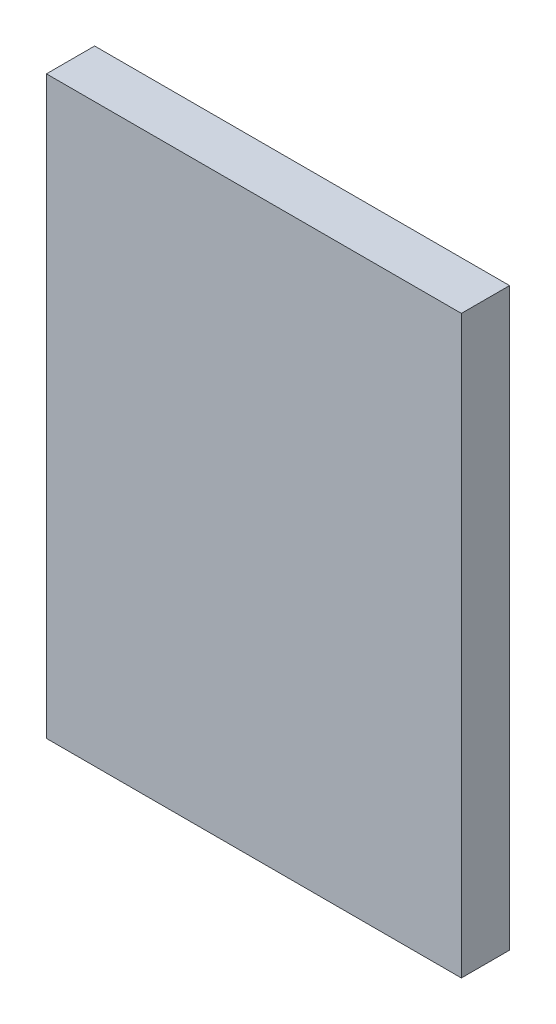
ISO-10303-21;
HEADER;
FILE_DESCRIPTION(('STEP AP214'),'2;1');
FILE_NAME('part.step','',(''),(''),'','','');
FILE_SCHEMA(('AUTOMOTIVE_DESIGN { 1 0 10303 214 1 1 1 1 }'));
ENDSEC;
DATA;
#1=APPLICATION_CONTEXT('core data for automotive mechanical design processes');
#2=APPLICATION_PROTOCOL_DEFINITION('international standard','automotive_design',2000,#1);
#3=PRODUCT_CONTEXT('',#1,'mechanical');
#4=PRODUCT('Part','Part','',(#3));
#5=PRODUCT_RELATED_PRODUCT_CATEGORY('part','',(#4));
#6=PRODUCT_DEFINITION_FORMATION('','',#4);
#7=PRODUCT_DEFINITION_CONTEXT('part definition',#1,'design');
#8=PRODUCT_DEFINITION('design','',#6,#7);
#9=PRODUCT_DEFINITION_SHAPE('','',#8);
#10=(LENGTH_UNIT() NAMED_UNIT(*) SI_UNIT(.MILLI.,.METRE.));
#11=(NAMED_UNIT(*) PLANE_ANGLE_UNIT() SI_UNIT($,.RADIAN.));
#12=(NAMED_UNIT(*) SI_UNIT($,.STERADIAN.) SOLID_ANGLE_UNIT());
#13=UNCERTAINTY_MEASURE_WITH_UNIT(LENGTH_MEASURE(1.E-05),#10,'distance_accuracy_value','');
#14=(GEOMETRIC_REPRESENTATION_CONTEXT(3) GLOBAL_UNCERTAINTY_ASSIGNED_CONTEXT((#13)) GLOBAL_UNIT_ASSIGNED_CONTEXT((#10,
#11,#12)) REPRESENTATION_CONTEXT('',''));
#15=CARTESIAN_POINT('',(0.,0.,0.));
#16=DIRECTION('',(0.,0.,1.));
#17=DIRECTION('',(1.,0.,0.));
#18=AXIS2_PLACEMENT_3D('',#15,#16,#17);
#19=CARTESIAN_POINT('',(0.,0.,0.018));
#20=DIRECTION('',(0.,0.,1.));
#21=DIRECTION('',(1.,0.,0.));
#22=AXIS2_PLACEMENT_3D('',#19,#20,#21);
#23=PLANE('',#22);
#24=DIRECTION('',(-1.,0.,0.));
#25=VECTOR('',#24,1.);
#26=CARTESIAN_POINT('',(-0.1243863753,0.1075,0.018));
#27=LINE('',#26,#25);
#28=CARTESIAN_POINT('',(0.2575,0.1075,0.0179999999999999));
#29=VERTEX_POINT('',#28);
#30=CARTESIAN_POINT('',(0.1025,0.1075,0.018));
#31=VERTEX_POINT('',#30);
#32=EDGE_CURVE('E11',#29,#31,#27,.T.);
#33=ORIENTED_EDGE('',*,*,#32,.T.);
#34=DIRECTION('',(0.,-1.,0.));
#35=VECTOR('',#34,1.);
#36=CARTESIAN_POINT('',(0.1025,0.02125,0.018));
#37=LINE('',#36,#35);
#38=CARTESIAN_POINT('',(0.1025,-0.1075,0.018));
#39=VERTEX_POINT('',#38);
#40=EDGE_CURVE('E24',#31,#39,#37,.T.);
#41=ORIENTED_EDGE('',*,*,#40,.T.);
#42=DIRECTION('',(1.,0.,0.));
#43=VECTOR('',#42,1.);
#44=CARTESIAN_POINT('',(-0.0468863753000002,-0.1075,0.018));
#45=LINE('',#44,#43);
#46=CARTESIAN_POINT('',(0.2575,-0.1075,0.0179999999999999));
#47=VERTEX_POINT('',#46);
#48=EDGE_CURVE('E88',#39,#47,#45,.T.);
#49=ORIENTED_EDGE('',*,*,#48,.T.);
#50=DIRECTION('',(0.,1.,0.));
#51=VECTOR('',#50,1.);
#52=CARTESIAN_POINT('',(0.2575,0.12875,0.0179999999999999));
#53=LINE('',#52,#51);
#54=EDGE_CURVE('E72',#47,#29,#53,.T.);
#55=ORIENTED_EDGE('',*,*,#54,.T.);
#56=EDGE_LOOP('',(#33,#41,#49,#55));
#57=FACE_BOUND('',#56,.T.);
#58=ADVANCED_FACE('F17',(#57),#23,.T.);
#59=CARTESIAN_POINT('',(0.1025,0.1075,0.018));
#60=DIRECTION('',(0.,1.,0.));
#61=DIRECTION('',(1.,0.,0.));
#62=AXIS2_PLACEMENT_3D('',#59,#60,#61);
#63=PLANE('',#62);
#64=DIRECTION('',(1.,0.,0.));
#65=VECTOR('',#64,1.);
#66=CARTESIAN_POINT('',(0.14125,0.1075,0.));
#67=LINE('',#66,#65);
#68=CARTESIAN_POINT('',(0.1025,0.1075,0.));
#69=VERTEX_POINT('',#68);
#70=CARTESIAN_POINT('',(0.2575,0.1075,0.));
#71=VERTEX_POINT('',#70);
#72=EDGE_CURVE('E75',#69,#71,#67,.T.);
#73=ORIENTED_EDGE('',*,*,#72,.F.);
#74=DIRECTION('',(0.,0.,-1.));
#75=VECTOR('',#74,1.);
#76=CARTESIAN_POINT('',(0.1025,0.1075,0.018));
#77=LINE('',#76,#75);
#78=EDGE_CURVE('E83',#31,#69,#77,.T.);
#79=ORIENTED_EDGE('',*,*,#78,.F.);
#80=ORIENTED_EDGE('',*,*,#32,.F.);
#81=DIRECTION('',(0.,0.,-1.));
#82=VECTOR('',#81,1.);
#83=CARTESIAN_POINT('',(0.2575,0.1075,0.0179999999999999));
#84=LINE('',#83,#82);
#85=EDGE_CURVE('E81',#29,#71,#84,.T.);
#86=ORIENTED_EDGE('',*,*,#85,.T.);
#87=EDGE_LOOP('',(#73,#79,#80,#86));
#88=FACE_BOUND('',#87,.T.);
#89=ADVANCED_FACE('F91',(#88),#63,.T.);
#90=CARTESIAN_POINT('',(0.1025,-0.1075,0.018));
#91=DIRECTION('',(-1.,0.,0.));
#92=DIRECTION('',(0.,1.,0.));
#93=AXIS2_PLACEMENT_3D('',#90,#91,#92);
#94=PLANE('',#93);
#95=DIRECTION('',(0.,1.,0.));
#96=VECTOR('',#95,1.);
#97=CARTESIAN_POINT('',(0.1025,-0.05375,0.));
#98=LINE('',#97,#96);
#99=CARTESIAN_POINT('',(0.1025,-0.1075,0.));
#100=VERTEX_POINT('',#99);
#101=EDGE_CURVE('E79',#100,#69,#98,.T.);
#102=ORIENTED_EDGE('',*,*,#101,.F.);
#103=DIRECTION('',(0.,0.,-1.));
#104=VECTOR('',#103,1.);
#105=CARTESIAN_POINT('',(0.1025,-0.1075,0.018));
#106=LINE('',#105,#104);
#107=EDGE_CURVE('E61',#39,#100,#106,.T.);
#108=ORIENTED_EDGE('',*,*,#107,.F.);
#109=ORIENTED_EDGE('',*,*,#40,.F.);
#110=ORIENTED_EDGE('',*,*,#78,.T.);
#111=EDGE_LOOP('',(#102,#108,#109,#110));
#112=FACE_BOUND('',#111,.T.);
#113=ADVANCED_FACE('F90',(#112),#94,.T.);
#114=CARTESIAN_POINT('',(0.2575,-0.1075,0.0179999999999999));
#115=DIRECTION('',(0.,-1.,0.));
#116=DIRECTION('',(-1.,0.,0.));
#117=AXIS2_PLACEMENT_3D('',#114,#115,#116);
#118=PLANE('',#117);
#119=DIRECTION('',(-1.,0.,0.));
#120=VECTOR('',#119,1.);
#121=CARTESIAN_POINT('',(0.21875,-0.1075,0.));
#122=LINE('',#121,#120);
#123=CARTESIAN_POINT('',(0.2575,-0.1075,0.));
#124=VERTEX_POINT('',#123);
#125=EDGE_CURVE('E55',#124,#100,#122,.T.);
#126=ORIENTED_EDGE('',*,*,#125,.F.);
#127=DIRECTION('',(0.,0.,-1.));
#128=VECTOR('',#127,1.);
#129=CARTESIAN_POINT('',(0.2575,-0.1075,0.0179999999999999));
#130=LINE('',#129,#128);
#131=EDGE_CURVE('E59',#47,#124,#130,.T.);
#132=ORIENTED_EDGE('',*,*,#131,.F.);
#133=ORIENTED_EDGE('',*,*,#48,.F.);
#134=ORIENTED_EDGE('',*,*,#107,.T.);
#135=EDGE_LOOP('',(#126,#132,#133,#134));
#136=FACE_BOUND('',#135,.T.);
#137=ADVANCED_FACE('F57',(#136),#118,.T.);
#138=CARTESIAN_POINT('',(0.2575,0.1075,0.0179999999999999));
#139=DIRECTION('',(1.,0.,0.));
#140=DIRECTION('',(0.,-1.,0.));
#141=AXIS2_PLACEMENT_3D('',#138,#139,#140);
#142=PLANE('',#141);
#143=DIRECTION('',(0.,-1.,0.));
#144=VECTOR('',#143,1.);
#145=CARTESIAN_POINT('',(0.2575,0.0537500000000001,0.));
#146=LINE('',#145,#144);
#147=EDGE_CURVE('E71',#71,#124,#146,.T.);
#148=ORIENTED_EDGE('',*,*,#147,.F.);
#149=ORIENTED_EDGE('',*,*,#85,.F.);
#150=ORIENTED_EDGE('',*,*,#54,.F.);
#151=ORIENTED_EDGE('',*,*,#131,.T.);
#152=EDGE_LOOP('',(#148,#149,#150,#151));
#153=FACE_BOUND('',#152,.T.);
#154=ADVANCED_FACE('F69',(#153),#142,.T.);
#155=CARTESIAN_POINT('',(0.18,0.,0.));
#156=DIRECTION('',(0.,0.,1.));
#157=DIRECTION('',(1.,0.,0.));
#158=AXIS2_PLACEMENT_3D('',#155,#156,#157);
#159=PLANE('',#158);
#160=ORIENTED_EDGE('',*,*,#101,.T.);
#161=ORIENTED_EDGE('',*,*,#72,.T.);
#162=ORIENTED_EDGE('',*,*,#147,.T.);
#163=ORIENTED_EDGE('',*,*,#125,.T.);
#164=EDGE_LOOP('',(#160,#161,#162,#163));
#165=FACE_BOUND('',#164,.T.);
#166=ADVANCED_FACE('F74',(#165),#159,.F.);
#167=CLOSED_SHELL('',(#58,#89,#113,#137,#154,#166));
#168=MANIFOLD_SOLID_BREP('B1',#167);
#169=ADVANCED_BREP_SHAPE_REPRESENTATION('',(#18,#168),#14);
#170=SHAPE_DEFINITION_REPRESENTATION(#9,#169);
ENDSEC;
END-ISO-10303-21;
